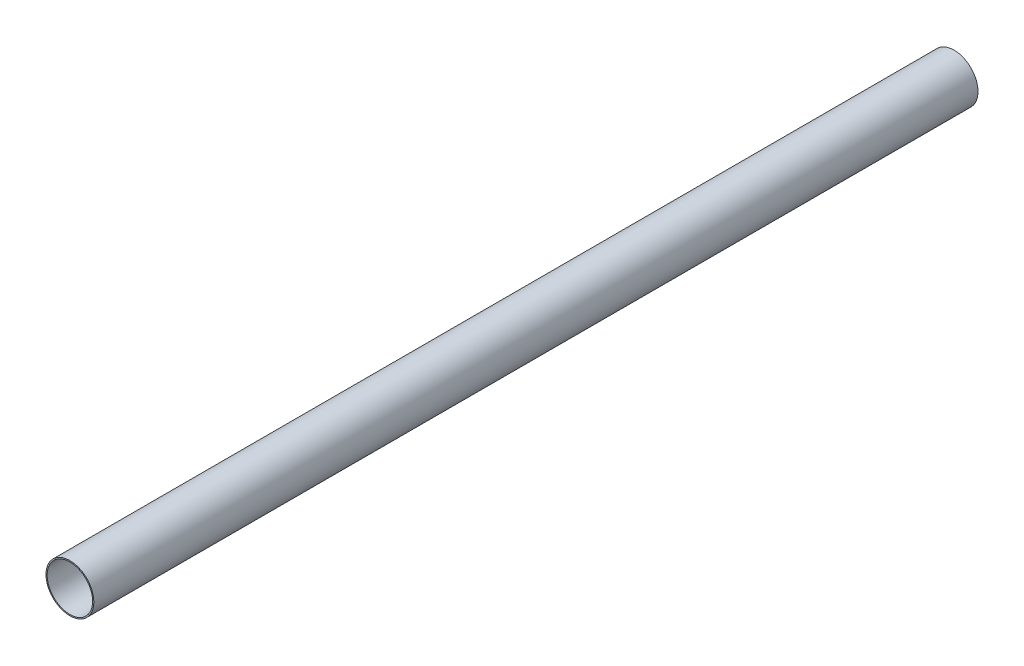
ISO-10303-21;
HEADER;
FILE_DESCRIPTION(('STEP AP214'),'2;1');
FILE_NAME('part.step','',(''),(''),'','','');
FILE_SCHEMA(('AUTOMOTIVE_DESIGN { 1 0 10303 214 1 1 1 1 }'));
ENDSEC;
DATA;
#1=APPLICATION_CONTEXT('core data for automotive mechanical design processes');
#2=APPLICATION_PROTOCOL_DEFINITION('international standard','automotive_design',2000,#1);
#3=PRODUCT_CONTEXT('',#1,'mechanical');
#4=PRODUCT('Part','Part','',(#3));
#5=PRODUCT_RELATED_PRODUCT_CATEGORY('part','',(#4));
#6=PRODUCT_DEFINITION_FORMATION('','',#4);
#7=PRODUCT_DEFINITION_CONTEXT('part definition',#1,'design');
#8=PRODUCT_DEFINITION('design','',#6,#7);
#9=PRODUCT_DEFINITION_SHAPE('','',#8);
#10=(LENGTH_UNIT() NAMED_UNIT(*) SI_UNIT(.MILLI.,.METRE.));
#11=(NAMED_UNIT(*) PLANE_ANGLE_UNIT() SI_UNIT($,.RADIAN.));
#12=(NAMED_UNIT(*) SI_UNIT($,.STERADIAN.) SOLID_ANGLE_UNIT());
#13=UNCERTAINTY_MEASURE_WITH_UNIT(LENGTH_MEASURE(1.E-05),#10,'distance_accuracy_value','');
#14=(GEOMETRIC_REPRESENTATION_CONTEXT(3) GLOBAL_UNCERTAINTY_ASSIGNED_CONTEXT((#13)) GLOBAL_UNIT_ASSIGNED_CONTEXT((#10,
#11,#12)) REPRESENTATION_CONTEXT('',''));
#15=CARTESIAN_POINT('',(0.,0.,0.));
#16=DIRECTION('',(0.,0.,1.));
#17=DIRECTION('',(1.,0.,0.));
#18=AXIS2_PLACEMENT_3D('',#15,#16,#17);
#19=CARTESIAN_POINT('',(0.,0.,563.88));
#20=DIRECTION('',(0.,0.,1.));
#21=DIRECTION('',(1.,0.,0.));
#22=AXIS2_PLACEMENT_3D('',#19,#20,#21);
#23=PLANE('',#22);
#24=CARTESIAN_POINT('',(0.,0.,563.88));
#25=DIRECTION('',(0.,0.,1.));
#26=DIRECTION('',(1.,0.,0.));
#27=AXIS2_PLACEMENT_3D('',#24,#25,#26);
#28=CIRCLE('',#27,15.265);
#29=CARTESIAN_POINT('',(15.265,0.,563.88));
#30=VERTEX_POINT('',#29);
#31=EDGE_CURVE('E10',#30,#30,#28,.T.);
#32=ORIENTED_EDGE('',*,*,#31,.T.);
#33=EDGE_LOOP('',(#32));
#34=FACE_BOUND('',#33,.T.);
#35=CARTESIAN_POINT('',(0.,0.,563.88));
#36=DIRECTION('',(0.,0.,1.));
#37=DIRECTION('',(1.,0.,0.));
#38=AXIS2_PLACEMENT_3D('',#35,#36,#37);
#39=CIRCLE('',#38,14.505);
#40=CARTESIAN_POINT('',(14.505,0.,563.88));
#41=VERTEX_POINT('',#40);
#42=EDGE_CURVE('E42',#41,#41,#39,.T.);
#43=ORIENTED_EDGE('',*,*,#42,.F.);
#44=EDGE_LOOP('',(#43));
#45=FACE_BOUND('',#44,.T.);
#46=ADVANCED_FACE('F31',(#34,#45),#23,.T.);
#47=CARTESIAN_POINT('',(0.,0.,0.));
#48=DIRECTION('',(0.,0.,1.));
#49=DIRECTION('',(1.,0.,0.));
#50=AXIS2_PLACEMENT_3D('',#47,#48,#49);
#51=PLANE('',#50);
#52=CARTESIAN_POINT('',(0.,0.,0.));
#53=DIRECTION('',(0.,0.,1.));
#54=DIRECTION('',(1.,0.,0.));
#55=AXIS2_PLACEMENT_3D('',#52,#53,#54);
#56=CIRCLE('',#55,15.265);
#57=CARTESIAN_POINT('',(15.265,0.,0.));
#58=VERTEX_POINT('',#57);
#59=EDGE_CURVE('E35',#58,#58,#56,.T.);
#60=ORIENTED_EDGE('',*,*,#59,.F.);
#61=EDGE_LOOP('',(#60));
#62=FACE_BOUND('',#61,.T.);
#63=CARTESIAN_POINT('',(0.,0.,0.));
#64=DIRECTION('',(0.,0.,1.));
#65=DIRECTION('',(1.,0.,0.));
#66=AXIS2_PLACEMENT_3D('',#63,#64,#65);
#67=CIRCLE('',#66,14.505);
#68=CARTESIAN_POINT('',(14.505,0.,0.));
#69=VERTEX_POINT('',#68);
#70=EDGE_CURVE('E44',#69,#69,#67,.T.);
#71=ORIENTED_EDGE('',*,*,#70,.T.);
#72=EDGE_LOOP('',(#71));
#73=FACE_BOUND('',#72,.T.);
#74=ADVANCED_FACE('F54',(#62,#73),#51,.F.);
#75=CARTESIAN_POINT('',(0.,0.,563.88));
#76=DIRECTION('',(0.,0.,-1.));
#77=DIRECTION('',(-1.,0.,0.));
#78=AXIS2_PLACEMENT_3D('',#75,#76,#77);
#79=CYLINDRICAL_SURFACE('',#78,15.265);
#80=ORIENTED_EDGE('',*,*,#31,.F.);
#81=EDGE_LOOP('',(#80));
#82=FACE_BOUND('',#81,.T.);
#83=ORIENTED_EDGE('',*,*,#59,.T.);
#84=EDGE_LOOP('',(#83));
#85=FACE_BOUND('',#84,.T.);
#86=ADVANCED_FACE('F33',(#82,#85),#79,.T.);
#87=CARTESIAN_POINT('',(0.,0.,563.88));
#88=DIRECTION('',(0.,0.,-1.));
#89=DIRECTION('',(-1.,0.,0.));
#90=AXIS2_PLACEMENT_3D('',#87,#88,#89);
#91=CYLINDRICAL_SURFACE('',#90,14.505);
#92=ORIENTED_EDGE('',*,*,#42,.T.);
#93=EDGE_LOOP('',(#92));
#94=FACE_BOUND('',#93,.T.);
#95=ORIENTED_EDGE('',*,*,#70,.F.);
#96=EDGE_LOOP('',(#95));
#97=FACE_BOUND('',#96,.T.);
#98=ADVANCED_FACE('F50',(#94,#97),#91,.F.);
#99=CLOSED_SHELL('',(#46,#74,#86,#98));
#100=MANIFOLD_SOLID_BREP('B2',#99);
#101=ADVANCED_BREP_SHAPE_REPRESENTATION('',(#18,#100),#14);
#102=SHAPE_DEFINITION_REPRESENTATION(#9,#101);
ENDSEC;
END-ISO-10303-21;
